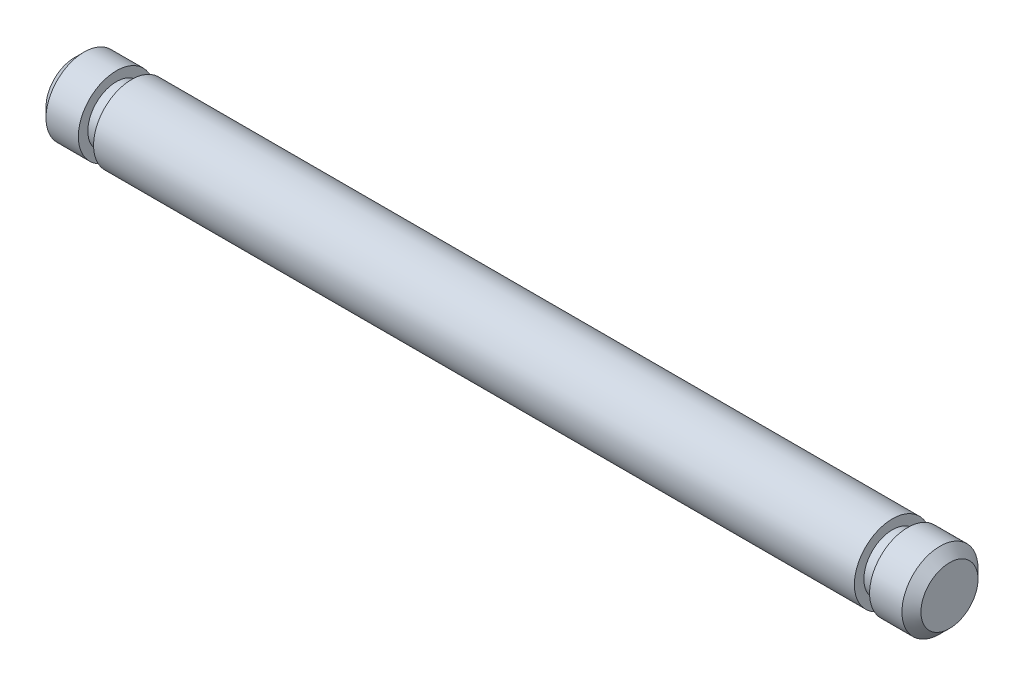
ISO-10303-21;
HEADER;
FILE_DESCRIPTION(('STEP AP214'),'2;1');
FILE_NAME('part.step','',(''),(''),'','','');
FILE_SCHEMA(('AUTOMOTIVE_DESIGN { 1 0 10303 214 1 1 1 1 }'));
ENDSEC;
DATA;
#1=APPLICATION_CONTEXT('core data for automotive mechanical design processes');
#2=APPLICATION_PROTOCOL_DEFINITION('international standard','automotive_design',2000,#1);
#3=PRODUCT_CONTEXT('',#1,'mechanical');
#4=PRODUCT('Part','Part','',(#3));
#5=PRODUCT_RELATED_PRODUCT_CATEGORY('part','',(#4));
#6=PRODUCT_DEFINITION_FORMATION('','',#4);
#7=PRODUCT_DEFINITION_CONTEXT('part definition',#1,'design');
#8=PRODUCT_DEFINITION('design','',#6,#7);
#9=PRODUCT_DEFINITION_SHAPE('','',#8);
#10=(LENGTH_UNIT() NAMED_UNIT(*) SI_UNIT(.MILLI.,.METRE.));
#11=(NAMED_UNIT(*) PLANE_ANGLE_UNIT() SI_UNIT($,.RADIAN.));
#12=(NAMED_UNIT(*) SI_UNIT($,.STERADIAN.) SOLID_ANGLE_UNIT());
#13=UNCERTAINTY_MEASURE_WITH_UNIT(LENGTH_MEASURE(1.E-05),#10,'distance_accuracy_value','');
#14=(GEOMETRIC_REPRESENTATION_CONTEXT(3) GLOBAL_UNCERTAINTY_ASSIGNED_CONTEXT((#13)) GLOBAL_UNIT_ASSIGNED_CONTEXT((#10,
#11,#12)) REPRESENTATION_CONTEXT('',''));
#15=CARTESIAN_POINT('',(0.,0.,0.));
#16=DIRECTION('',(0.,0.,1.));
#17=DIRECTION('',(1.,0.,0.));
#18=AXIS2_PLACEMENT_3D('',#15,#16,#17);
#19=CARTESIAN_POINT('',(46.,0.,0.));
#20=DIRECTION('',(-1.,0.,0.));
#21=DIRECTION('',(0.,0.,1.));
#22=AXIS2_PLACEMENT_3D('',#19,#20,#21);
#23=CYLINDRICAL_SURFACE('',#22,2.);
#24=CARTESIAN_POINT('',(43.,0.,0.));
#25=DIRECTION('',(1.,0.,0.));
#26=DIRECTION('',(0.,0.,-1.));
#27=AXIS2_PLACEMENT_3D('',#24,#25,#26);
#28=CIRCLE('',#27,2.);
#29=CARTESIAN_POINT('',(43.,0.,-2.));
#30=VERTEX_POINT('',#29);
#31=EDGE_CURVE('E67',#30,#30,#28,.T.);
#32=ORIENTED_EDGE('',*,*,#31,.F.);
#33=EDGE_LOOP('',(#32));
#34=FACE_BOUND('',#33,.T.);
#35=CARTESIAN_POINT('',(3.,0.,0.));
#36=DIRECTION('',(-1.,0.,0.));
#37=DIRECTION('',(0.,0.,1.));
#38=AXIS2_PLACEMENT_3D('',#35,#36,#37);
#39=CIRCLE('',#38,2.);
#40=CARTESIAN_POINT('',(3.,0.,2.));
#41=VERTEX_POINT('',#40);
#42=EDGE_CURVE('E83',#41,#41,#39,.T.);
#43=ORIENTED_EDGE('',*,*,#42,.F.);
#44=EDGE_LOOP('',(#43));
#45=FACE_BOUND('',#44,.T.);
#46=ADVANCED_FACE('F41',(#34,#45),#23,.T.);
#47=CARTESIAN_POINT('',(43.8,0.,0.));
#48=DIRECTION('',(1.,0.,0.));
#49=DIRECTION('',(0.,0.,-1.));
#50=AXIS2_PLACEMENT_3D('',#47,#48,#49);
#51=CIRCLE('',#50,2.);
#52=CARTESIAN_POINT('',(43.8,0.,-2.));
#53=VERTEX_POINT('',#52);
#54=EDGE_CURVE('E66',#53,#53,#51,.T.);
#55=ORIENTED_EDGE('',*,*,#54,.T.);
#56=EDGE_LOOP('',(#55));
#57=FACE_BOUND('',#56,.T.);
#58=CARTESIAN_POINT('',(45.5,0.,0.));
#59=DIRECTION('',(1.,0.,0.));
#60=DIRECTION('',(0.,0.,-1.));
#61=AXIS2_PLACEMENT_3D('',#58,#59,#60);
#62=CIRCLE('',#61,2.);
#63=CARTESIAN_POINT('',(45.5,0.,-2.));
#64=VERTEX_POINT('',#63);
#65=EDGE_CURVE('E60',#64,#64,#62,.F.);
#66=ORIENTED_EDGE('',*,*,#65,.T.);
#67=EDGE_LOOP('',(#66));
#68=FACE_BOUND('',#67,.T.);
#69=ADVANCED_FACE('F120',(#57,#68),#23,.T.);
#70=CARTESIAN_POINT('',(46.,0.,0.));
#71=DIRECTION('',(1.,0.,0.));
#72=DIRECTION('',(0.,0.,-1.));
#73=AXIS2_PLACEMENT_3D('',#70,#71,#72);
#74=PLANE('',#73);
#75=CARTESIAN_POINT('',(46.,0.,0.));
#76=DIRECTION('',(1.,0.,0.));
#77=DIRECTION('',(0.,0.,-1.));
#78=AXIS2_PLACEMENT_3D('',#75,#76,#77);
#79=CIRCLE('',#78,1.49999999999999);
#80=CARTESIAN_POINT('',(46.,0.,-1.49999999999999));
#81=VERTEX_POINT('',#80);
#82=EDGE_CURVE('E10',#81,#81,#79,.T.);
#83=ORIENTED_EDGE('',*,*,#82,.T.);
#84=EDGE_LOOP('',(#83));
#85=FACE_BOUND('',#84,.T.);
#86=ADVANCED_FACE('F127',(#85),#74,.T.);
#87=CARTESIAN_POINT('',(46.,0.,0.));
#88=DIRECTION('',(-1.,0.,0.));
#89=DIRECTION('',(0.,0.,1.));
#90=AXIS2_PLACEMENT_3D('',#87,#88,#89);
#91=CONICAL_SURFACE('',#90,1.49999999999999,0.785398163397453);
#92=ORIENTED_EDGE('',*,*,#65,.F.);
#93=EDGE_LOOP('',(#92));
#94=FACE_BOUND('',#93,.T.);
#95=ORIENTED_EDGE('',*,*,#82,.F.);
#96=EDGE_LOOP('',(#95));
#97=FACE_BOUND('',#96,.T.);
#98=ADVANCED_FACE('F44',(#94,#97),#91,.T.);
#99=CARTESIAN_POINT('',(43.8,0.,0.));
#100=DIRECTION('',(1.,0.,0.));
#101=DIRECTION('',(0.,0.,-1.));
#102=AXIS2_PLACEMENT_3D('',#99,#100,#101);
#103=PLANE('',#102);
#104=ORIENTED_EDGE('',*,*,#54,.F.);
#105=EDGE_LOOP('',(#104));
#106=FACE_BOUND('',#105,.T.);
#107=CARTESIAN_POINT('',(43.8,0.,0.));
#108=DIRECTION('',(1.,0.,0.));
#109=DIRECTION('',(0.,0.,-1.));
#110=AXIS2_PLACEMENT_3D('',#107,#108,#109);
#111=CIRCLE('',#110,1.5);
#112=CARTESIAN_POINT('',(43.8,0.,-1.5));
#113=VERTEX_POINT('',#112);
#114=EDGE_CURVE('E71',#113,#113,#111,.T.);
#115=ORIENTED_EDGE('',*,*,#114,.T.);
#116=EDGE_LOOP('',(#115));
#117=FACE_BOUND('',#116,.T.);
#118=ADVANCED_FACE('F159',(#106,#117),#103,.F.);
#119=CARTESIAN_POINT('',(43.,0.,0.));
#120=DIRECTION('',(1.,0.,0.));
#121=DIRECTION('',(0.,0.,-1.));
#122=AXIS2_PLACEMENT_3D('',#119,#120,#121);
#123=PLANE('',#122);
#124=ORIENTED_EDGE('',*,*,#31,.T.);
#125=EDGE_LOOP('',(#124));
#126=FACE_BOUND('',#125,.T.);
#127=CARTESIAN_POINT('',(43.,0.,0.));
#128=DIRECTION('',(1.,0.,0.));
#129=DIRECTION('',(0.,0.,-1.));
#130=AXIS2_PLACEMENT_3D('',#127,#128,#129);
#131=CIRCLE('',#130,1.5);
#132=CARTESIAN_POINT('',(43.,0.,-1.5));
#133=VERTEX_POINT('',#132);
#134=EDGE_CURVE('E75',#133,#133,#131,.T.);
#135=ORIENTED_EDGE('',*,*,#134,.F.);
#136=EDGE_LOOP('',(#135));
#137=FACE_BOUND('',#136,.T.);
#138=ADVANCED_FACE('F156',(#126,#137),#123,.T.);
#139=CARTESIAN_POINT('',(43.8,0.,0.));
#140=DIRECTION('',(-1.,0.,0.));
#141=DIRECTION('',(0.,0.,1.));
#142=AXIS2_PLACEMENT_3D('',#139,#140,#141);
#143=CYLINDRICAL_SURFACE('',#142,1.5);
#144=ORIENTED_EDGE('',*,*,#114,.F.);
#145=EDGE_LOOP('',(#144));
#146=FACE_BOUND('',#145,.T.);
#147=ORIENTED_EDGE('',*,*,#134,.T.);
#148=EDGE_LOOP('',(#147));
#149=FACE_BOUND('',#148,.T.);
#150=ADVANCED_FACE('F115',(#146,#149),#143,.T.);
#151=CARTESIAN_POINT('',(2.2,0.,0.));
#152=DIRECTION('',(-1.,0.,0.));
#153=DIRECTION('',(0.,0.,1.));
#154=AXIS2_PLACEMENT_3D('',#151,#152,#153);
#155=PLANE('',#154);
#156=CARTESIAN_POINT('',(2.2,0.,0.));
#157=DIRECTION('',(-1.,0.,0.));
#158=DIRECTION('',(0.,0.,1.));
#159=AXIS2_PLACEMENT_3D('',#156,#157,#158);
#160=CIRCLE('',#159,2.);
#161=CARTESIAN_POINT('',(2.2,0.,2.));
#162=VERTEX_POINT('',#161);
#163=EDGE_CURVE('E79',#162,#162,#160,.T.);
#164=ORIENTED_EDGE('',*,*,#163,.F.);
#165=EDGE_LOOP('',(#164));
#166=FACE_BOUND('',#165,.T.);
#167=CARTESIAN_POINT('',(2.2,0.,0.));
#168=DIRECTION('',(-1.,0.,0.));
#169=DIRECTION('',(0.,0.,1.));
#170=AXIS2_PLACEMENT_3D('',#167,#168,#169);
#171=CIRCLE('',#170,1.49999999999999);
#172=CARTESIAN_POINT('',(2.2,0.,1.49999999999999));
#173=VERTEX_POINT('',#172);
#174=EDGE_CURVE('E87',#173,#173,#171,.T.);
#175=ORIENTED_EDGE('',*,*,#174,.T.);
#176=EDGE_LOOP('',(#175));
#177=FACE_BOUND('',#176,.T.);
#178=ADVANCED_FACE('F99',(#166,#177),#155,.F.);
#179=CARTESIAN_POINT('',(3.,0.,0.));
#180=DIRECTION('',(-1.,0.,0.));
#181=DIRECTION('',(0.,0.,1.));
#182=AXIS2_PLACEMENT_3D('',#179,#180,#181);
#183=PLANE('',#182);
#184=ORIENTED_EDGE('',*,*,#42,.T.);
#185=EDGE_LOOP('',(#184));
#186=FACE_BOUND('',#185,.T.);
#187=CARTESIAN_POINT('',(3.,0.,0.));
#188=DIRECTION('',(-1.,0.,0.));
#189=DIRECTION('',(0.,0.,1.));
#190=AXIS2_PLACEMENT_3D('',#187,#188,#189);
#191=CIRCLE('',#190,1.49999999999999);
#192=CARTESIAN_POINT('',(3.,0.,1.49999999999999));
#193=VERTEX_POINT('',#192);
#194=EDGE_CURVE('E91',#193,#193,#191,.T.);
#195=ORIENTED_EDGE('',*,*,#194,.F.);
#196=EDGE_LOOP('',(#195));
#197=FACE_BOUND('',#196,.T.);
#198=ADVANCED_FACE('F105',(#186,#197),#183,.T.);
#199=CARTESIAN_POINT('',(2.2,0.,0.));
#200=DIRECTION('',(1.,0.,0.));
#201=DIRECTION('',(0.,0.,-1.));
#202=AXIS2_PLACEMENT_3D('',#199,#200,#201);
#203=CYLINDRICAL_SURFACE('',#202,1.49999999999999);
#204=ORIENTED_EDGE('',*,*,#174,.F.);
#205=EDGE_LOOP('',(#204));
#206=FACE_BOUND('',#205,.T.);
#207=ORIENTED_EDGE('',*,*,#194,.T.);
#208=EDGE_LOOP('',(#207));
#209=FACE_BOUND('',#208,.T.);
#210=ADVANCED_FACE('F101',(#206,#209),#203,.T.);
#211=CARTESIAN_POINT('',(0.,0.,0.));
#212=DIRECTION('',(1.,0.,0.));
#213=DIRECTION('',(0.,0.,-1.));
#214=AXIS2_PLACEMENT_3D('',#211,#212,#213);
#215=PLANE('',#214);
#216=CARTESIAN_POINT('',(0.,0.,0.));
#217=DIRECTION('',(1.,0.,0.));
#218=DIRECTION('',(0.,0.,-1.));
#219=AXIS2_PLACEMENT_3D('',#216,#217,#218);
#220=CIRCLE('',#219,1.49999999999999);
#221=CARTESIAN_POINT('',(0.,0.,-1.49999999999999));
#222=VERTEX_POINT('',#221);
#223=EDGE_CURVE('E50',#222,#222,#220,.F.);
#224=ORIENTED_EDGE('',*,*,#223,.T.);
#225=EDGE_LOOP('',(#224));
#226=FACE_BOUND('',#225,.T.);
#227=ADVANCED_FACE('F104',(#226),#215,.F.);
#228=CARTESIAN_POINT('',(0.500000000000014,0.,0.));
#229=DIRECTION('',(1.,0.,0.));
#230=DIRECTION('',(0.,0.,-1.));
#231=AXIS2_PLACEMENT_3D('',#228,#229,#230);
#232=CONICAL_SURFACE('',#231,2.,0.785398163397447);
#233=ORIENTED_EDGE('',*,*,#223,.F.);
#234=EDGE_LOOP('',(#233));
#235=FACE_BOUND('',#234,.T.);
#236=CARTESIAN_POINT('',(0.500000000000014,0.,0.));
#237=DIRECTION('',(1.,0.,0.));
#238=DIRECTION('',(0.,0.,-1.));
#239=AXIS2_PLACEMENT_3D('',#236,#237,#238);
#240=CIRCLE('',#239,2.);
#241=CARTESIAN_POINT('',(0.500000000000014,0.,-2.));
#242=VERTEX_POINT('',#241);
#243=EDGE_CURVE('E55',#242,#242,#240,.T.);
#244=ORIENTED_EDGE('',*,*,#243,.F.);
#245=EDGE_LOOP('',(#244));
#246=FACE_BOUND('',#245,.T.);
#247=ADVANCED_FACE('F133',(#235,#246),#232,.T.);
#248=ORIENTED_EDGE('',*,*,#163,.T.);
#249=EDGE_LOOP('',(#248));
#250=FACE_BOUND('',#249,.T.);
#251=ORIENTED_EDGE('',*,*,#243,.T.);
#252=EDGE_LOOP('',(#251));
#253=FACE_BOUND('',#252,.T.);
#254=ADVANCED_FACE('F123',(#250,#253),#23,.T.);
#255=CLOSED_SHELL('',(#46,#69,#86,#98,#118,#138,#150,#178,#198,#210,#227,#247,#254));
#256=MANIFOLD_SOLID_BREP('B2',#255);
#257=ADVANCED_BREP_SHAPE_REPRESENTATION('',(#18,#256),#14);
#258=SHAPE_DEFINITION_REPRESENTATION(#9,#257);
ENDSEC;
END-ISO-10303-21;
